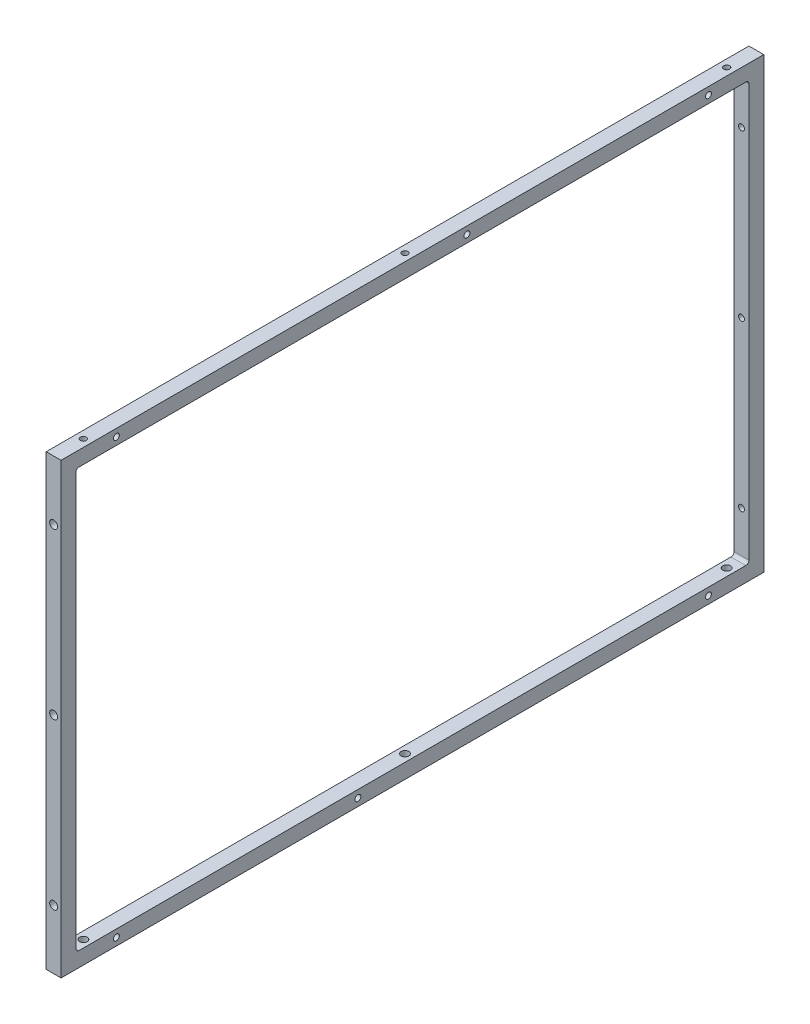
ISO-10303-21;
HEADER;
FILE_DESCRIPTION(('STEP AP214'),'2;1');
FILE_NAME('part.step','',(''),(''),'','','');
FILE_SCHEMA(('AUTOMOTIVE_DESIGN { 1 0 10303 214 1 1 1 1 }'));
ENDSEC;
DATA;
#1=APPLICATION_CONTEXT('core data for automotive mechanical design processes');
#2=APPLICATION_PROTOCOL_DEFINITION('international standard','automotive_design',2000,#1);
#3=PRODUCT_CONTEXT('',#1,'mechanical');
#4=PRODUCT('Part','Part','',(#3));
#5=PRODUCT_RELATED_PRODUCT_CATEGORY('part','',(#4));
#6=PRODUCT_DEFINITION_FORMATION('','',#4);
#7=PRODUCT_DEFINITION_CONTEXT('part definition',#1,'design');
#8=PRODUCT_DEFINITION('design','',#6,#7);
#9=PRODUCT_DEFINITION_SHAPE('','',#8);
#10=(LENGTH_UNIT() NAMED_UNIT(*) SI_UNIT(.MILLI.,.METRE.));
#11=(NAMED_UNIT(*) PLANE_ANGLE_UNIT() SI_UNIT($,.RADIAN.));
#12=(NAMED_UNIT(*) SI_UNIT($,.STERADIAN.) SOLID_ANGLE_UNIT());
#13=UNCERTAINTY_MEASURE_WITH_UNIT(LENGTH_MEASURE(1.E-05),#10,'distance_accuracy_value','');
#14=(GEOMETRIC_REPRESENTATION_CONTEXT(3) GLOBAL_UNCERTAINTY_ASSIGNED_CONTEXT((#13)) GLOBAL_UNIT_ASSIGNED_CONTEXT((#10,
#11,#12)) REPRESENTATION_CONTEXT('',''));
#15=CARTESIAN_POINT('',(0.,0.,0.));
#16=DIRECTION('',(0.,0.,1.));
#17=DIRECTION('',(1.,0.,0.));
#18=AXIS2_PLACEMENT_3D('',#15,#16,#17);
#19=CARTESIAN_POINT('',(9.525,0.,0.));
#20=DIRECTION('',(1.,0.,0.));
#21=DIRECTION('',(0.,0.,-1.));
#22=AXIS2_PLACEMENT_3D('',#19,#20,#21);
#23=PLANE('',#22);
#24=CARTESIAN_POINT('',(9.525,139.12320835,-190.));
#25=DIRECTION('',(-1.,0.,0.));
#26=DIRECTION('',(0.,0.,1.));
#27=AXIS2_PLACEMENT_3D('',#24,#25,#26);
#28=CIRCLE('',#27,1.89865);
#29=CARTESIAN_POINT('',(9.525,139.12320835,-188.10135));
#30=VERTEX_POINT('',#29);
#31=EDGE_CURVE('E398',#30,#30,#28,.T.);
#32=ORIENTED_EDGE('',*,*,#31,.T.);
#33=EDGE_LOOP('',(#32));
#34=FACE_BOUND('',#33,.T.);
#35=CARTESIAN_POINT('',(9.525,139.12320835,-35.));
#36=DIRECTION('',(-1.,0.,0.));
#37=DIRECTION('',(0.,0.,1.));
#38=AXIS2_PLACEMENT_3D('',#35,#36,#37);
#39=CIRCLE('',#38,1.89865);
#40=CARTESIAN_POINT('',(9.525,139.12320835,-33.10135));
#41=VERTEX_POINT('',#40);
#42=EDGE_CURVE('E403',#41,#41,#39,.T.);
#43=ORIENTED_EDGE('',*,*,#42,.T.);
#44=EDGE_LOOP('',(#43));
#45=FACE_BOUND('',#44,.T.);
#46=CARTESIAN_POINT('',(9.525,-139.12320835,-190.));
#47=DIRECTION('',(-1.,0.,0.));
#48=DIRECTION('',(0.,0.,1.));
#49=AXIS2_PLACEMENT_3D('',#46,#47,#48);
#50=CIRCLE('',#49,1.89865);
#51=CARTESIAN_POINT('',(9.525,-139.12320835,-188.10135));
#52=VERTEX_POINT('',#51);
#53=EDGE_CURVE('E409',#52,#52,#50,.T.);
#54=ORIENTED_EDGE('',*,*,#53,.T.);
#55=EDGE_LOOP('',(#54));
#56=FACE_BOUND('',#55,.T.);
#57=CARTESIAN_POINT('',(9.525,-139.12320835,35.));
#58=DIRECTION('',(-1.,0.,0.));
#59=DIRECTION('',(0.,0.,1.));
#60=AXIS2_PLACEMENT_3D('',#57,#58,#59);
#61=CIRCLE('',#60,1.89865);
#62=CARTESIAN_POINT('',(9.525,-139.12320835,36.89865));
#63=VERTEX_POINT('',#62);
#64=EDGE_CURVE('E415',#63,#63,#61,.T.);
#65=ORIENTED_EDGE('',*,*,#64,.T.);
#66=EDGE_LOOP('',(#65));
#67=FACE_BOUND('',#66,.T.);
#68=CARTESIAN_POINT('',(9.525,-139.12320835,190.));
#69=DIRECTION('',(-1.,0.,0.));
#70=DIRECTION('',(0.,0.,1.));
#71=AXIS2_PLACEMENT_3D('',#68,#69,#70);
#72=CIRCLE('',#71,1.89865);
#73=CARTESIAN_POINT('',(9.525,-139.12320835,191.89865));
#74=VERTEX_POINT('',#73);
#75=EDGE_CURVE('E421',#74,#74,#72,.T.);
#76=ORIENTED_EDGE('',*,*,#75,.T.);
#77=EDGE_LOOP('',(#76));
#78=FACE_BOUND('',#77,.T.);
#79=CARTESIAN_POINT('',(9.525,139.12320835,190.));
#80=DIRECTION('',(-1.,0.,0.));
#81=DIRECTION('',(0.,0.,1.));
#82=AXIS2_PLACEMENT_3D('',#79,#80,#81);
#83=CIRCLE('',#82,1.89865);
#84=CARTESIAN_POINT('',(9.525,139.12320835,191.89865));
#85=VERTEX_POINT('',#84);
#86=EDGE_CURVE('E427',#85,#85,#83,.T.);
#87=ORIENTED_EDGE('',*,*,#86,.T.);
#88=EDGE_LOOP('',(#87));
#89=FACE_BOUND('',#88,.T.);
#90=DIRECTION('',(0.,-1.,0.));
#91=VECTOR('',#90,1.);
#92=CARTESIAN_POINT('',(9.525,143.88570835,225.5));
#93=LINE('',#92,#91);
#94=CARTESIAN_POINT('',(9.525,143.88570835,225.5));
#95=VERTEX_POINT('',#94);
#96=CARTESIAN_POINT('',(9.525,-143.88570835,225.5));
#97=VERTEX_POINT('',#96);
#98=EDGE_CURVE('E161',#95,#97,#93,.T.);
#99=ORIENTED_EDGE('',*,*,#98,.T.);
#100=DIRECTION('',(0.,0.,-1.));
#101=VECTOR('',#100,1.);
#102=CARTESIAN_POINT('',(9.525,-143.88570835,225.5));
#103=LINE('',#102,#101);
#104=CARTESIAN_POINT('',(9.525,-143.88570835,-225.5));
#105=VERTEX_POINT('',#104);
#106=EDGE_CURVE('E150',#97,#105,#103,.T.);
#107=ORIENTED_EDGE('',*,*,#106,.T.);
#108=DIRECTION('',(0.,1.,0.));
#109=VECTOR('',#108,1.);
#110=CARTESIAN_POINT('',(9.525,143.88570835,-225.5));
#111=LINE('',#110,#109);
#112=CARTESIAN_POINT('',(9.525,143.88570835,-225.5));
#113=VERTEX_POINT('',#112);
#114=EDGE_CURVE('E160',#105,#113,#111,.T.);
#115=ORIENTED_EDGE('',*,*,#114,.T.);
#116=DIRECTION('',(0.,0.,1.));
#117=VECTOR('',#116,1.);
#118=CARTESIAN_POINT('',(9.525,143.88570835,225.5));
#119=LINE('',#118,#117);
#120=EDGE_CURVE('E165',#113,#95,#119,.T.);
#121=ORIENTED_EDGE('',*,*,#120,.T.);
#122=EDGE_LOOP('',(#99,#107,#115,#121));
#123=FACE_BOUND('',#122,.T.);
#124=DIRECTION('',(0.,0.,-1.));
#125=VECTOR('',#124,1.);
#126=CARTESIAN_POINT('',(9.525,-134.36070835,225.5));
#127=LINE('',#126,#125);
#128=CARTESIAN_POINT('',(9.525,-134.36070835,213.975));
#129=VERTEX_POINT('',#128);
#130=CARTESIAN_POINT('',(9.525,-134.36070835,-213.975));
#131=VERTEX_POINT('',#130);
#132=EDGE_CURVE('E230',#129,#131,#127,.T.);
#133=ORIENTED_EDGE('',*,*,#132,.F.);
#134=CARTESIAN_POINT('',(9.525,-132.36070835,213.975));
#135=DIRECTION('',(1.,0.,0.));
#136=DIRECTION('',(0.,0.,-1.));
#137=AXIS2_PLACEMENT_3D('',#134,#135,#136);
#138=CIRCLE('',#137,2.);
#139=CARTESIAN_POINT('',(9.525,-132.36070835,215.975));
#140=VERTEX_POINT('',#139);
#141=EDGE_CURVE('E204',#129,#140,#138,.F.);
#142=ORIENTED_EDGE('',*,*,#141,.T.);
#143=DIRECTION('',(0.,-1.,0.));
#144=VECTOR('',#143,1.);
#145=CARTESIAN_POINT('',(9.525,143.88570835,215.975));
#146=LINE('',#145,#144);
#147=CARTESIAN_POINT('',(9.525,132.36070835,215.975));
#148=VERTEX_POINT('',#147);
#149=EDGE_CURVE('E224',#148,#140,#146,.T.);
#150=ORIENTED_EDGE('',*,*,#149,.F.);
#151=CARTESIAN_POINT('',(9.525,132.36070835,213.975));
#152=DIRECTION('',(1.,0.,0.));
#153=DIRECTION('',(0.,0.,-1.));
#154=AXIS2_PLACEMENT_3D('',#151,#152,#153);
#155=CIRCLE('',#154,2.);
#156=CARTESIAN_POINT('',(9.525,134.36070835,213.975));
#157=VERTEX_POINT('',#156);
#158=EDGE_CURVE('E200',#148,#157,#155,.F.);
#159=ORIENTED_EDGE('',*,*,#158,.T.);
#160=DIRECTION('',(0.,0.,1.));
#161=VECTOR('',#160,1.);
#162=CARTESIAN_POINT('',(9.525,134.36070835,225.5));
#163=LINE('',#162,#161);
#164=CARTESIAN_POINT('',(9.525,134.36070835,-213.975));
#165=VERTEX_POINT('',#164);
#166=EDGE_CURVE('E229',#165,#157,#163,.T.);
#167=ORIENTED_EDGE('',*,*,#166,.F.);
#168=CARTESIAN_POINT('',(9.525,132.36070835,-213.975));
#169=DIRECTION('',(1.,0.,0.));
#170=DIRECTION('',(0.,0.,-1.));
#171=AXIS2_PLACEMENT_3D('',#168,#169,#170);
#172=CIRCLE('',#171,2.);
#173=CARTESIAN_POINT('',(9.525,132.36070835,-215.975));
#174=VERTEX_POINT('',#173);
#175=EDGE_CURVE('E12',#165,#174,#172,.F.);
#176=ORIENTED_EDGE('',*,*,#175,.T.);
#177=DIRECTION('',(0.,1.,0.));
#178=VECTOR('',#177,1.);
#179=CARTESIAN_POINT('',(9.525,143.88570835,-215.975));
#180=LINE('',#179,#178);
#181=CARTESIAN_POINT('',(9.525,-132.36070835,-215.975));
#182=VERTEX_POINT('',#181);
#183=EDGE_CURVE('E227',#182,#174,#180,.T.);
#184=ORIENTED_EDGE('',*,*,#183,.F.);
#185=CARTESIAN_POINT('',(9.525,-132.36070835,-213.975));
#186=DIRECTION('',(1.,0.,0.));
#187=DIRECTION('',(0.,0.,-1.));
#188=AXIS2_PLACEMENT_3D('',#185,#186,#187);
#189=CIRCLE('',#188,2.);
#190=EDGE_CURVE('E208',#182,#131,#189,.F.);
#191=ORIENTED_EDGE('',*,*,#190,.T.);
#192=EDGE_LOOP('',(#133,#142,#150,#159,#167,#176,#184,#191));
#193=FACE_BOUND('',#192,.T.);
#194=ADVANCED_FACE('F60',(#34,#45,#56,#67,#78,#89,#123,#193),#23,.T.);
#195=CARTESIAN_POINT('',(0.,0.,0.));
#196=DIRECTION('',(1.,0.,0.));
#197=DIRECTION('',(0.,0.,-1.));
#198=AXIS2_PLACEMENT_3D('',#195,#196,#197);
#199=PLANE('',#198);
#200=CARTESIAN_POINT('',(0.,139.12320835,-190.));
#201=DIRECTION('',(-1.,0.,0.));
#202=DIRECTION('',(0.,0.,1.));
#203=AXIS2_PLACEMENT_3D('',#200,#201,#202);
#204=CIRCLE('',#203,1.89864999999997);
#205=CARTESIAN_POINT('',(0.,139.12320835,-188.10135));
#206=VERTEX_POINT('',#205);
#207=EDGE_CURVE('E395',#206,#206,#204,.T.);
#208=ORIENTED_EDGE('',*,*,#207,.F.);
#209=EDGE_LOOP('',(#208));
#210=FACE_BOUND('',#209,.T.);
#211=CARTESIAN_POINT('',(0.,139.12320835,-35.));
#212=DIRECTION('',(-1.,0.,0.));
#213=DIRECTION('',(0.,0.,1.));
#214=AXIS2_PLACEMENT_3D('',#211,#212,#213);
#215=CIRCLE('',#214,1.89864999999997);
#216=CARTESIAN_POINT('',(0.,139.12320835,-33.10135));
#217=VERTEX_POINT('',#216);
#218=EDGE_CURVE('E400',#217,#217,#215,.T.);
#219=ORIENTED_EDGE('',*,*,#218,.F.);
#220=EDGE_LOOP('',(#219));
#221=FACE_BOUND('',#220,.T.);
#222=CARTESIAN_POINT('',(0.,-139.12320835,-190.));
#223=DIRECTION('',(-1.,0.,0.));
#224=DIRECTION('',(0.,0.,1.));
#225=AXIS2_PLACEMENT_3D('',#222,#223,#224);
#226=CIRCLE('',#225,1.89864999999997);
#227=CARTESIAN_POINT('',(0.,-139.12320835,-188.10135));
#228=VERTEX_POINT('',#227);
#229=EDGE_CURVE('E406',#228,#228,#226,.T.);
#230=ORIENTED_EDGE('',*,*,#229,.F.);
#231=EDGE_LOOP('',(#230));
#232=FACE_BOUND('',#231,.T.);
#233=CARTESIAN_POINT('',(0.,-139.12320835,35.));
#234=DIRECTION('',(-1.,0.,0.));
#235=DIRECTION('',(0.,0.,1.));
#236=AXIS2_PLACEMENT_3D('',#233,#234,#235);
#237=CIRCLE('',#236,1.89864999999997);
#238=CARTESIAN_POINT('',(0.,-139.12320835,36.89865));
#239=VERTEX_POINT('',#238);
#240=EDGE_CURVE('E412',#239,#239,#237,.T.);
#241=ORIENTED_EDGE('',*,*,#240,.F.);
#242=EDGE_LOOP('',(#241));
#243=FACE_BOUND('',#242,.T.);
#244=CARTESIAN_POINT('',(0.,-139.12320835,190.));
#245=DIRECTION('',(-1.,0.,0.));
#246=DIRECTION('',(0.,0.,1.));
#247=AXIS2_PLACEMENT_3D('',#244,#245,#246);
#248=CIRCLE('',#247,1.89864999999997);
#249=CARTESIAN_POINT('',(0.,-139.12320835,191.89865));
#250=VERTEX_POINT('',#249);
#251=EDGE_CURVE('E418',#250,#250,#248,.T.);
#252=ORIENTED_EDGE('',*,*,#251,.F.);
#253=EDGE_LOOP('',(#252));
#254=FACE_BOUND('',#253,.T.);
#255=CARTESIAN_POINT('',(0.,139.12320835,190.));
#256=DIRECTION('',(-1.,0.,0.));
#257=DIRECTION('',(0.,0.,1.));
#258=AXIS2_PLACEMENT_3D('',#255,#256,#257);
#259=CIRCLE('',#258,1.89864999999997);
#260=CARTESIAN_POINT('',(0.,139.12320835,191.89865));
#261=VERTEX_POINT('',#260);
#262=EDGE_CURVE('E424',#261,#261,#259,.T.);
#263=ORIENTED_EDGE('',*,*,#262,.F.);
#264=EDGE_LOOP('',(#263));
#265=FACE_BOUND('',#264,.T.);
#266=DIRECTION('',(0.,-1.,0.));
#267=VECTOR('',#266,1.);
#268=CARTESIAN_POINT('',(0.,143.88570835,225.5));
#269=LINE('',#268,#267);
#270=CARTESIAN_POINT('',(0.,143.88570835,225.5));
#271=VERTEX_POINT('',#270);
#272=CARTESIAN_POINT('',(0.,-143.88570835,225.5));
#273=VERTEX_POINT('',#272);
#274=EDGE_CURVE('E173',#271,#273,#269,.T.);
#275=ORIENTED_EDGE('',*,*,#274,.F.);
#276=DIRECTION('',(0.,0.,1.));
#277=VECTOR('',#276,1.);
#278=CARTESIAN_POINT('',(0.,143.88570835,225.5));
#279=LINE('',#278,#277);
#280=CARTESIAN_POINT('',(0.,143.88570835,-225.5));
#281=VERTEX_POINT('',#280);
#282=EDGE_CURVE('E169',#281,#271,#279,.T.);
#283=ORIENTED_EDGE('',*,*,#282,.F.);
#284=DIRECTION('',(0.,1.,0.));
#285=VECTOR('',#284,1.);
#286=CARTESIAN_POINT('',(0.,143.88570835,-225.5));
#287=LINE('',#286,#285);
#288=CARTESIAN_POINT('',(0.,-143.88570835,-225.5));
#289=VERTEX_POINT('',#288);
#290=EDGE_CURVE('E251',#289,#281,#287,.T.);
#291=ORIENTED_EDGE('',*,*,#290,.F.);
#292=DIRECTION('',(0.,0.,-1.));
#293=VECTOR('',#292,1.);
#294=CARTESIAN_POINT('',(0.,-143.88570835,225.5));
#295=LINE('',#294,#293);
#296=EDGE_CURVE('E249',#273,#289,#295,.T.);
#297=ORIENTED_EDGE('',*,*,#296,.F.);
#298=EDGE_LOOP('',(#275,#283,#291,#297));
#299=FACE_BOUND('',#298,.T.);
#300=DIRECTION('',(0.,0.,1.));
#301=VECTOR('',#300,1.);
#302=CARTESIAN_POINT('',(0.,134.36070835,225.5));
#303=LINE('',#302,#301);
#304=CARTESIAN_POINT('',(0.,134.36070835,-213.975));
#305=VERTEX_POINT('',#304);
#306=CARTESIAN_POINT('',(0.,134.36070835,213.975));
#307=VERTEX_POINT('',#306);
#308=EDGE_CURVE('E215',#305,#307,#303,.T.);
#309=ORIENTED_EDGE('',*,*,#308,.T.);
#310=CARTESIAN_POINT('',(0.,132.36070835,213.975));
#311=DIRECTION('',(1.,0.,0.));
#312=DIRECTION('',(0.,0.,-1.));
#313=AXIS2_PLACEMENT_3D('',#310,#311,#312);
#314=CIRCLE('',#313,2.);
#315=CARTESIAN_POINT('',(0.,132.36070835,215.975));
#316=VERTEX_POINT('',#315);
#317=EDGE_CURVE('E198',#307,#316,#314,.T.);
#318=ORIENTED_EDGE('',*,*,#317,.T.);
#319=DIRECTION('',(0.,-1.,0.));
#320=VECTOR('',#319,1.);
#321=CARTESIAN_POINT('',(0.,143.88570835,215.975));
#322=LINE('',#321,#320);
#323=CARTESIAN_POINT('',(0.,-132.36070835,215.975));
#324=VERTEX_POINT('',#323);
#325=EDGE_CURVE('E237',#316,#324,#322,.T.);
#326=ORIENTED_EDGE('',*,*,#325,.T.);
#327=CARTESIAN_POINT('',(0.,-132.36070835,213.975));
#328=DIRECTION('',(1.,0.,0.));
#329=DIRECTION('',(0.,0.,-1.));
#330=AXIS2_PLACEMENT_3D('',#327,#328,#329);
#331=CIRCLE('',#330,2.);
#332=CARTESIAN_POINT('',(0.,-134.36070835,213.975));
#333=VERTEX_POINT('',#332);
#334=EDGE_CURVE('E202',#324,#333,#331,.T.);
#335=ORIENTED_EDGE('',*,*,#334,.T.);
#336=DIRECTION('',(0.,0.,-1.));
#337=VECTOR('',#336,1.);
#338=CARTESIAN_POINT('',(0.,-134.36070835,225.5));
#339=LINE('',#338,#337);
#340=CARTESIAN_POINT('',(0.,-134.36070835,-213.975));
#341=VERTEX_POINT('',#340);
#342=EDGE_CURVE('E240',#333,#341,#339,.T.);
#343=ORIENTED_EDGE('',*,*,#342,.T.);
#344=CARTESIAN_POINT('',(0.,-132.36070835,-213.975));
#345=DIRECTION('',(1.,0.,0.));
#346=DIRECTION('',(0.,0.,-1.));
#347=AXIS2_PLACEMENT_3D('',#344,#345,#346);
#348=CIRCLE('',#347,2.);
#349=CARTESIAN_POINT('',(0.,-132.36070835,-215.975));
#350=VERTEX_POINT('',#349);
#351=EDGE_CURVE('E206',#341,#350,#348,.T.);
#352=ORIENTED_EDGE('',*,*,#351,.T.);
#353=DIRECTION('',(0.,1.,0.));
#354=VECTOR('',#353,1.);
#355=CARTESIAN_POINT('',(0.,143.88570835,-215.975));
#356=LINE('',#355,#354);
#357=CARTESIAN_POINT('',(0.,132.36070835,-215.975));
#358=VERTEX_POINT('',#357);
#359=EDGE_CURVE('E216',#350,#358,#356,.T.);
#360=ORIENTED_EDGE('',*,*,#359,.T.);
#361=CARTESIAN_POINT('',(0.,132.36070835,-213.975));
#362=DIRECTION('',(1.,0.,0.));
#363=DIRECTION('',(0.,0.,-1.));
#364=AXIS2_PLACEMENT_3D('',#361,#362,#363);
#365=CIRCLE('',#364,2.);
#366=EDGE_CURVE('E69',#358,#305,#365,.T.);
#367=ORIENTED_EDGE('',*,*,#366,.T.);
#368=EDGE_LOOP('',(#309,#318,#326,#335,#343,#352,#360,#367));
#369=FACE_BOUND('',#368,.T.);
#370=ADVANCED_FACE('F214',(#210,#221,#232,#243,#254,#265,#299,#369),#199,.F.);
#371=CARTESIAN_POINT('',(9.525,143.88570835,225.5));
#372=DIRECTION('',(0.,0.,-1.));
#373=DIRECTION('',(0.,1.,0.));
#374=AXIS2_PLACEMENT_3D('',#371,#372,#373);
#375=PLANE('',#374);
#376=CARTESIAN_POINT('',(4.76249999999999,105.78570835,225.5));
#377=DIRECTION('',(0.,0.,1.));
#378=DIRECTION('',(1.,0.,0.));
#379=AXIS2_PLACEMENT_3D('',#376,#377,#378);
#380=CIRCLE('',#379,2.55269999999999);
#381=CARTESIAN_POINT('',(7.31519999999998,105.78570835,225.5));
#382=VERTEX_POINT('',#381);
#383=EDGE_CURVE('E430',#382,#382,#380,.T.);
#384=ORIENTED_EDGE('',*,*,#383,.F.);
#385=EDGE_LOOP('',(#384));
#386=FACE_BOUND('',#385,.T.);
#387=CARTESIAN_POINT('',(4.76249999999998,0.,225.5));
#388=DIRECTION('',(0.,0.,1.));
#389=DIRECTION('',(1.,0.,0.));
#390=AXIS2_PLACEMENT_3D('',#387,#388,#389);
#391=CIRCLE('',#390,2.55269999999999);
#392=CARTESIAN_POINT('',(7.31519999999997,0.,225.5));
#393=VERTEX_POINT('',#392);
#394=EDGE_CURVE('E436',#393,#393,#391,.T.);
#395=ORIENTED_EDGE('',*,*,#394,.F.);
#396=EDGE_LOOP('',(#395));
#397=FACE_BOUND('',#396,.T.);
#398=CARTESIAN_POINT('',(4.76249999999999,-105.78570835,225.5));
#399=DIRECTION('',(0.,0.,1.));
#400=DIRECTION('',(1.,0.,0.));
#401=AXIS2_PLACEMENT_3D('',#398,#399,#400);
#402=CIRCLE('',#401,2.55269999999999);
#403=CARTESIAN_POINT('',(7.31519999999998,-105.78570835,225.5));
#404=VERTEX_POINT('',#403);
#405=EDGE_CURVE('E442',#404,#404,#402,.T.);
#406=ORIENTED_EDGE('',*,*,#405,.F.);
#407=EDGE_LOOP('',(#406));
#408=FACE_BOUND('',#407,.T.);
#409=ORIENTED_EDGE('',*,*,#274,.T.);
#410=DIRECTION('',(-1.,0.,0.));
#411=VECTOR('',#410,1.);
#412=CARTESIAN_POINT('',(9.525,-143.88570835,225.5));
#413=LINE('',#412,#411);
#414=EDGE_CURVE('E154',#97,#273,#413,.T.);
#415=ORIENTED_EDGE('',*,*,#414,.F.);
#416=ORIENTED_EDGE('',*,*,#98,.F.);
#417=DIRECTION('',(-1.,0.,0.));
#418=VECTOR('',#417,1.);
#419=CARTESIAN_POINT('',(9.525,143.88570835,225.5));
#420=LINE('',#419,#418);
#421=EDGE_CURVE('E247',#95,#271,#420,.T.);
#422=ORIENTED_EDGE('',*,*,#421,.T.);
#423=EDGE_LOOP('',(#409,#415,#416,#422));
#424=FACE_BOUND('',#423,.T.);
#425=ADVANCED_FACE('F171',(#386,#397,#408,#424),#375,.F.);
#426=CARTESIAN_POINT('',(9.525,-143.88570835,225.5));
#427=DIRECTION('',(0.,1.,0.));
#428=DIRECTION('',(0.,0.,1.));
#429=AXIS2_PLACEMENT_3D('',#426,#427,#428);
#430=PLANE('',#429);
#431=CARTESIAN_POINT('',(4.7625,-143.88570835,-206.45));
#432=DIRECTION('',(0.,-1.,0.));
#433=DIRECTION('',(0.,0.,-1.));
#434=AXIS2_PLACEMENT_3D('',#431,#432,#433);
#435=CIRCLE('',#434,2.48919999999999);
#436=CARTESIAN_POINT('',(4.7625,-143.88570835,-208.9392));
#437=VERTEX_POINT('',#436);
#438=EDGE_CURVE('E466',#437,#437,#435,.T.);
#439=ORIENTED_EDGE('',*,*,#438,.F.);
#440=EDGE_LOOP('',(#439));
#441=FACE_BOUND('',#440,.T.);
#442=CARTESIAN_POINT('',(4.7625,-143.88570835,0.));
#443=DIRECTION('',(0.,-1.,0.));
#444=DIRECTION('',(0.,0.,-1.));
#445=AXIS2_PLACEMENT_3D('',#442,#443,#444);
#446=CIRCLE('',#445,2.48919999999999);
#447=CARTESIAN_POINT('',(4.7625,-143.88570835,-2.48919999999999));
#448=VERTEX_POINT('',#447);
#449=EDGE_CURVE('E472',#448,#448,#446,.T.);
#450=ORIENTED_EDGE('',*,*,#449,.F.);
#451=EDGE_LOOP('',(#450));
#452=FACE_BOUND('',#451,.T.);
#453=CARTESIAN_POINT('',(4.7625,-143.88570835,206.45));
#454=DIRECTION('',(0.,-1.,0.));
#455=DIRECTION('',(0.,0.,-1.));
#456=AXIS2_PLACEMENT_3D('',#453,#454,#455);
#457=CIRCLE('',#456,2.48919999999999);
#458=CARTESIAN_POINT('',(4.7625,-143.88570835,203.9608));
#459=VERTEX_POINT('',#458);
#460=EDGE_CURVE('E478',#459,#459,#457,.T.);
#461=ORIENTED_EDGE('',*,*,#460,.F.);
#462=EDGE_LOOP('',(#461));
#463=FACE_BOUND('',#462,.T.);
#464=ORIENTED_EDGE('',*,*,#296,.T.);
#465=DIRECTION('',(-1.,0.,0.));
#466=VECTOR('',#465,1.);
#467=CARTESIAN_POINT('',(9.525,-143.88570835,-225.5));
#468=LINE('',#467,#466);
#469=EDGE_CURVE('E157',#105,#289,#468,.T.);
#470=ORIENTED_EDGE('',*,*,#469,.F.);
#471=ORIENTED_EDGE('',*,*,#106,.F.);
#472=ORIENTED_EDGE('',*,*,#414,.T.);
#473=EDGE_LOOP('',(#464,#470,#471,#472));
#474=FACE_BOUND('',#473,.T.);
#475=ADVANCED_FACE('F152',(#441,#452,#463,#474),#430,.F.);
#476=CARTESIAN_POINT('',(9.525,143.88570835,-225.5));
#477=DIRECTION('',(0.,0.,1.));
#478=DIRECTION('',(0.,-1.,0.));
#479=AXIS2_PLACEMENT_3D('',#476,#477,#478);
#480=PLANE('',#479);
#481=CARTESIAN_POINT('',(4.76249999999999,105.78570835,-225.5));
#482=DIRECTION('',(0.,0.,-1.));
#483=DIRECTION('',(0.,1.,0.));
#484=AXIS2_PLACEMENT_3D('',#481,#482,#483);
#485=CIRCLE('',#484,1.89864999999999);
#486=CARTESIAN_POINT('',(4.76249999999999,107.68435835,-225.5));
#487=VERTEX_POINT('',#486);
#488=EDGE_CURVE('E448',#487,#487,#485,.T.);
#489=ORIENTED_EDGE('',*,*,#488,.F.);
#490=EDGE_LOOP('',(#489));
#491=FACE_BOUND('',#490,.T.);
#492=CARTESIAN_POINT('',(4.76249999999998,0.,-225.5));
#493=DIRECTION('',(0.,0.,-1.));
#494=DIRECTION('',(0.,1.,0.));
#495=AXIS2_PLACEMENT_3D('',#492,#493,#494);
#496=CIRCLE('',#495,1.89864999999999);
#497=CARTESIAN_POINT('',(4.76249999999998,1.89865000000003,-225.5));
#498=VERTEX_POINT('',#497);
#499=EDGE_CURVE('E454',#498,#498,#496,.T.);
#500=ORIENTED_EDGE('',*,*,#499,.F.);
#501=EDGE_LOOP('',(#500));
#502=FACE_BOUND('',#501,.T.);
#503=CARTESIAN_POINT('',(4.76249999999999,-105.78570835,-225.5));
#504=DIRECTION('',(0.,0.,-1.));
#505=DIRECTION('',(0.,1.,0.));
#506=AXIS2_PLACEMENT_3D('',#503,#504,#505);
#507=CIRCLE('',#506,1.89864999999999);
#508=CARTESIAN_POINT('',(4.76249999999999,-103.88705835,-225.5));
#509=VERTEX_POINT('',#508);
#510=EDGE_CURVE('E460',#509,#509,#507,.T.);
#511=ORIENTED_EDGE('',*,*,#510,.F.);
#512=EDGE_LOOP('',(#511));
#513=FACE_BOUND('',#512,.T.);
#514=ORIENTED_EDGE('',*,*,#290,.T.);
#515=DIRECTION('',(-1.,0.,0.));
#516=VECTOR('',#515,1.);
#517=CARTESIAN_POINT('',(9.525,143.88570835,-225.5));
#518=LINE('',#517,#516);
#519=EDGE_CURVE('E178',#113,#281,#518,.T.);
#520=ORIENTED_EDGE('',*,*,#519,.F.);
#521=ORIENTED_EDGE('',*,*,#114,.F.);
#522=ORIENTED_EDGE('',*,*,#469,.T.);
#523=EDGE_LOOP('',(#514,#520,#521,#522));
#524=FACE_BOUND('',#523,.T.);
#525=ADVANCED_FACE('F262',(#491,#502,#513,#524),#480,.F.);
#526=CARTESIAN_POINT('',(9.525,143.88570835,225.5));
#527=DIRECTION('',(0.,-1.,0.));
#528=DIRECTION('',(0.,0.,-1.));
#529=AXIS2_PLACEMENT_3D('',#526,#527,#528);
#530=PLANE('',#529);
#531=CARTESIAN_POINT('',(4.7625,143.88570835,-206.45));
#532=DIRECTION('',(0.,1.,0.));
#533=DIRECTION('',(0.,0.,1.));
#534=AXIS2_PLACEMENT_3D('',#531,#532,#533);
#535=CIRCLE('',#534,1.89864999999999);
#536=CARTESIAN_POINT('',(4.7625,143.88570835,-204.55135));
#537=VERTEX_POINT('',#536);
#538=EDGE_CURVE('E380',#537,#537,#535,.T.);
#539=ORIENTED_EDGE('',*,*,#538,.F.);
#540=EDGE_LOOP('',(#539));
#541=FACE_BOUND('',#540,.T.);
#542=CARTESIAN_POINT('',(4.7625,143.88570835,0.));
#543=DIRECTION('',(0.,1.,0.));
#544=DIRECTION('',(0.,0.,1.));
#545=AXIS2_PLACEMENT_3D('',#542,#543,#544);
#546=CIRCLE('',#545,1.89864999999999);
#547=CARTESIAN_POINT('',(4.7625,143.88570835,1.89864999999999));
#548=VERTEX_POINT('',#547);
#549=EDGE_CURVE('E382',#548,#548,#546,.T.);
#550=ORIENTED_EDGE('',*,*,#549,.F.);
#551=EDGE_LOOP('',(#550));
#552=FACE_BOUND('',#551,.T.);
#553=CARTESIAN_POINT('',(4.7625,143.88570835,206.45));
#554=DIRECTION('',(0.,1.,0.));
#555=DIRECTION('',(0.,0.,1.));
#556=AXIS2_PLACEMENT_3D('',#553,#554,#555);
#557=CIRCLE('',#556,1.89864999999999);
#558=CARTESIAN_POINT('',(4.7625,143.88570835,208.34865));
#559=VERTEX_POINT('',#558);
#560=EDGE_CURVE('E389',#559,#559,#557,.T.);
#561=ORIENTED_EDGE('',*,*,#560,.F.);
#562=EDGE_LOOP('',(#561));
#563=FACE_BOUND('',#562,.T.);
#564=ORIENTED_EDGE('',*,*,#282,.T.);
#565=ORIENTED_EDGE('',*,*,#421,.F.);
#566=ORIENTED_EDGE('',*,*,#120,.F.);
#567=ORIENTED_EDGE('',*,*,#519,.T.);
#568=EDGE_LOOP('',(#564,#565,#566,#567));
#569=FACE_BOUND('',#568,.T.);
#570=ADVANCED_FACE('F258',(#541,#552,#563,#569),#530,.F.);
#571=CARTESIAN_POINT('',(9.525,143.88570835,215.975));
#572=DIRECTION('',(0.,0.,-1.));
#573=DIRECTION('',(0.,1.,0.));
#574=AXIS2_PLACEMENT_3D('',#571,#572,#573);
#575=PLANE('',#574);
#576=CARTESIAN_POINT('',(4.76249999999999,105.78570835,215.975));
#577=DIRECTION('',(0.,0.,-1.));
#578=DIRECTION('',(0.,1.,0.));
#579=AXIS2_PLACEMENT_3D('',#576,#577,#578);
#580=CIRCLE('',#579,2.55269999999997);
#581=CARTESIAN_POINT('',(4.76249999999999,108.33840835,215.975));
#582=VERTEX_POINT('',#581);
#583=EDGE_CURVE('E433',#582,#582,#580,.T.);
#584=ORIENTED_EDGE('',*,*,#583,.F.);
#585=EDGE_LOOP('',(#584));
#586=FACE_BOUND('',#585,.T.);
#587=CARTESIAN_POINT('',(4.76249999999998,0.,215.975));
#588=DIRECTION('',(0.,0.,-1.));
#589=DIRECTION('',(0.,1.,0.));
#590=AXIS2_PLACEMENT_3D('',#587,#588,#589);
#591=CIRCLE('',#590,2.55269999999997);
#592=CARTESIAN_POINT('',(4.76249999999998,2.5527,215.975));
#593=VERTEX_POINT('',#592);
#594=EDGE_CURVE('E439',#593,#593,#591,.T.);
#595=ORIENTED_EDGE('',*,*,#594,.F.);
#596=EDGE_LOOP('',(#595));
#597=FACE_BOUND('',#596,.T.);
#598=CARTESIAN_POINT('',(4.76249999999999,-105.78570835,215.975));
#599=DIRECTION('',(0.,0.,-1.));
#600=DIRECTION('',(0.,1.,0.));
#601=AXIS2_PLACEMENT_3D('',#598,#599,#600);
#602=CIRCLE('',#601,2.55269999999997);
#603=CARTESIAN_POINT('',(4.76249999999999,-103.23300835,215.975));
#604=VERTEX_POINT('',#603);
#605=EDGE_CURVE('E445',#604,#604,#602,.T.);
#606=ORIENTED_EDGE('',*,*,#605,.F.);
#607=EDGE_LOOP('',(#606));
#608=FACE_BOUND('',#607,.T.);
#609=ORIENTED_EDGE('',*,*,#325,.F.);
#610=DIRECTION('',(-1.,0.,0.));
#611=VECTOR('',#610,1.);
#612=CARTESIAN_POINT('',(9.525,132.36070835,215.975));
#613=LINE('',#612,#611);
#614=EDGE_CURVE('E187',#316,#148,#613,.F.);
#615=ORIENTED_EDGE('',*,*,#614,.T.);
#616=ORIENTED_EDGE('',*,*,#149,.T.);
#617=DIRECTION('',(-1.,0.,0.));
#618=VECTOR('',#617,1.);
#619=CARTESIAN_POINT('',(0.,-132.36070835,215.975));
#620=LINE('',#619,#618);
#621=EDGE_CURVE('E184',#140,#324,#620,.T.);
#622=ORIENTED_EDGE('',*,*,#621,.T.);
#623=EDGE_LOOP('',(#609,#615,#616,#622));
#624=FACE_BOUND('',#623,.T.);
#625=ADVANCED_FACE('F270',(#586,#597,#608,#624),#575,.T.);
#626=CARTESIAN_POINT('',(9.525,-134.36070835,225.5));
#627=DIRECTION('',(0.,1.,0.));
#628=DIRECTION('',(0.,0.,1.));
#629=AXIS2_PLACEMENT_3D('',#626,#627,#628);
#630=PLANE('',#629);
#631=CARTESIAN_POINT('',(4.7625,-134.36070835,-206.45));
#632=DIRECTION('',(0.,1.,0.));
#633=DIRECTION('',(0.,0.,1.));
#634=AXIS2_PLACEMENT_3D('',#631,#632,#633);
#635=CIRCLE('',#634,2.48919999999999);
#636=CARTESIAN_POINT('',(4.7625,-134.36070835,-203.9608));
#637=VERTEX_POINT('',#636);
#638=EDGE_CURVE('E469',#637,#637,#635,.T.);
#639=ORIENTED_EDGE('',*,*,#638,.F.);
#640=EDGE_LOOP('',(#639));
#641=FACE_BOUND('',#640,.T.);
#642=CARTESIAN_POINT('',(4.7625,-134.36070835,0.));
#643=DIRECTION('',(0.,1.,0.));
#644=DIRECTION('',(0.,0.,1.));
#645=AXIS2_PLACEMENT_3D('',#642,#643,#644);
#646=CIRCLE('',#645,2.48919999999999);
#647=CARTESIAN_POINT('',(4.7625,-134.36070835,2.48919999999999));
#648=VERTEX_POINT('',#647);
#649=EDGE_CURVE('E475',#648,#648,#646,.T.);
#650=ORIENTED_EDGE('',*,*,#649,.F.);
#651=EDGE_LOOP('',(#650));
#652=FACE_BOUND('',#651,.T.);
#653=CARTESIAN_POINT('',(4.7625,-134.36070835,206.45));
#654=DIRECTION('',(0.,1.,0.));
#655=DIRECTION('',(0.,0.,1.));
#656=AXIS2_PLACEMENT_3D('',#653,#654,#655);
#657=CIRCLE('',#656,2.48919999999999);
#658=CARTESIAN_POINT('',(4.7625,-134.36070835,208.9392));
#659=VERTEX_POINT('',#658);
#660=EDGE_CURVE('E241',#659,#659,#657,.T.);
#661=ORIENTED_EDGE('',*,*,#660,.F.);
#662=EDGE_LOOP('',(#661));
#663=FACE_BOUND('',#662,.T.);
#664=ORIENTED_EDGE('',*,*,#342,.F.);
#665=DIRECTION('',(-1.,0.,0.));
#666=VECTOR('',#665,1.);
#667=CARTESIAN_POINT('',(9.525,-134.36070835,213.975));
#668=LINE('',#667,#666);
#669=EDGE_CURVE('E192',#333,#129,#668,.F.);
#670=ORIENTED_EDGE('',*,*,#669,.T.);
#671=ORIENTED_EDGE('',*,*,#132,.T.);
#672=DIRECTION('',(-1.,0.,0.));
#673=VECTOR('',#672,1.);
#674=CARTESIAN_POINT('',(0.,-134.36070835,-213.975));
#675=LINE('',#674,#673);
#676=EDGE_CURVE('E189',#131,#341,#675,.T.);
#677=ORIENTED_EDGE('',*,*,#676,.T.);
#678=EDGE_LOOP('',(#664,#670,#671,#677));
#679=FACE_BOUND('',#678,.T.);
#680=ADVANCED_FACE('F290',(#641,#652,#663,#679),#630,.T.);
#681=CARTESIAN_POINT('',(9.525,143.88570835,-215.975));
#682=DIRECTION('',(0.,0.,1.));
#683=DIRECTION('',(0.,-1.,0.));
#684=AXIS2_PLACEMENT_3D('',#681,#682,#683);
#685=PLANE('',#684);
#686=CARTESIAN_POINT('',(4.76249999999999,105.78570835,-215.975));
#687=DIRECTION('',(0.,0.,1.));
#688=DIRECTION('',(0.,-1.,0.));
#689=AXIS2_PLACEMENT_3D('',#686,#687,#688);
#690=CIRCLE('',#689,1.89864999999998);
#691=CARTESIAN_POINT('',(4.76249999999999,103.88705835,-215.975));
#692=VERTEX_POINT('',#691);
#693=EDGE_CURVE('E451',#692,#692,#690,.T.);
#694=ORIENTED_EDGE('',*,*,#693,.F.);
#695=EDGE_LOOP('',(#694));
#696=FACE_BOUND('',#695,.T.);
#697=CARTESIAN_POINT('',(4.76249999999998,0.,-215.975));
#698=DIRECTION('',(0.,0.,1.));
#699=DIRECTION('',(0.,-1.,0.));
#700=AXIS2_PLACEMENT_3D('',#697,#698,#699);
#701=CIRCLE('',#700,1.89864999999998);
#702=CARTESIAN_POINT('',(4.76249999999998,-1.89864999999994,-215.975));
#703=VERTEX_POINT('',#702);
#704=EDGE_CURVE('E457',#703,#703,#701,.T.);
#705=ORIENTED_EDGE('',*,*,#704,.F.);
#706=EDGE_LOOP('',(#705));
#707=FACE_BOUND('',#706,.T.);
#708=CARTESIAN_POINT('',(4.76249999999999,-105.78570835,-215.975));
#709=DIRECTION('',(0.,0.,1.));
#710=DIRECTION('',(0.,-1.,0.));
#711=AXIS2_PLACEMENT_3D('',#708,#709,#710);
#712=CIRCLE('',#711,1.89864999999998);
#713=CARTESIAN_POINT('',(4.76249999999999,-107.68435835,-215.975));
#714=VERTEX_POINT('',#713);
#715=EDGE_CURVE('E463',#714,#714,#712,.T.);
#716=ORIENTED_EDGE('',*,*,#715,.F.);
#717=EDGE_LOOP('',(#716));
#718=FACE_BOUND('',#717,.T.);
#719=ORIENTED_EDGE('',*,*,#359,.F.);
#720=DIRECTION('',(-1.,0.,0.));
#721=VECTOR('',#720,1.);
#722=CARTESIAN_POINT('',(9.525,-132.36070835,-215.975));
#723=LINE('',#722,#721);
#724=EDGE_CURVE('E81',#350,#182,#723,.F.);
#725=ORIENTED_EDGE('',*,*,#724,.T.);
#726=ORIENTED_EDGE('',*,*,#183,.T.);
#727=DIRECTION('',(-1.,0.,0.));
#728=VECTOR('',#727,1.);
#729=CARTESIAN_POINT('',(0.,132.36070835,-215.975));
#730=LINE('',#729,#728);
#731=EDGE_CURVE('E194',#174,#358,#730,.T.);
#732=ORIENTED_EDGE('',*,*,#731,.T.);
#733=EDGE_LOOP('',(#719,#725,#726,#732));
#734=FACE_BOUND('',#733,.T.);
#735=ADVANCED_FACE('F226',(#696,#707,#718,#734),#685,.T.);
#736=CARTESIAN_POINT('',(9.525,134.36070835,225.5));
#737=DIRECTION('',(0.,-1.,0.));
#738=DIRECTION('',(0.,0.,-1.));
#739=AXIS2_PLACEMENT_3D('',#736,#737,#738);
#740=PLANE('',#739);
#741=CARTESIAN_POINT('',(4.7625,134.36070835,-206.45));
#742=DIRECTION('',(0.,-1.,0.));
#743=DIRECTION('',(0.,0.,-1.));
#744=AXIS2_PLACEMENT_3D('',#741,#742,#743);
#745=CIRCLE('',#744,1.89864999999999);
#746=CARTESIAN_POINT('',(4.7625,134.36070835,-208.34865));
#747=VERTEX_POINT('',#746);
#748=EDGE_CURVE('E64',#747,#747,#745,.T.);
#749=ORIENTED_EDGE('',*,*,#748,.F.);
#750=EDGE_LOOP('',(#749));
#751=FACE_BOUND('',#750,.T.);
#752=CARTESIAN_POINT('',(4.7625,134.36070835,0.));
#753=DIRECTION('',(0.,-1.,0.));
#754=DIRECTION('',(0.,0.,-1.));
#755=AXIS2_PLACEMENT_3D('',#752,#753,#754);
#756=CIRCLE('',#755,1.89864999999999);
#757=CARTESIAN_POINT('',(4.7625,134.36070835,-1.89864999999999));
#758=VERTEX_POINT('',#757);
#759=EDGE_CURVE('E386',#758,#758,#756,.T.);
#760=ORIENTED_EDGE('',*,*,#759,.F.);
#761=EDGE_LOOP('',(#760));
#762=FACE_BOUND('',#761,.T.);
#763=CARTESIAN_POINT('',(4.7625,134.36070835,206.45));
#764=DIRECTION('',(0.,-1.,0.));
#765=DIRECTION('',(0.,0.,-1.));
#766=AXIS2_PLACEMENT_3D('',#763,#764,#765);
#767=CIRCLE('',#766,1.89864999999999);
#768=CARTESIAN_POINT('',(4.7625,134.36070835,204.55135));
#769=VERTEX_POINT('',#768);
#770=EDGE_CURVE('E392',#769,#769,#767,.T.);
#771=ORIENTED_EDGE('',*,*,#770,.F.);
#772=EDGE_LOOP('',(#771));
#773=FACE_BOUND('',#772,.T.);
#774=ORIENTED_EDGE('',*,*,#166,.T.);
#775=DIRECTION('',(-1.,0.,0.));
#776=VECTOR('',#775,1.);
#777=CARTESIAN_POINT('',(0.,134.36070835,213.975));
#778=LINE('',#777,#776);
#779=EDGE_CURVE('E176',#157,#307,#778,.T.);
#780=ORIENTED_EDGE('',*,*,#779,.T.);
#781=ORIENTED_EDGE('',*,*,#308,.F.);
#782=DIRECTION('',(-1.,0.,0.));
#783=VECTOR('',#782,1.);
#784=CARTESIAN_POINT('',(9.525,134.36070835,-213.975));
#785=LINE('',#784,#783);
#786=EDGE_CURVE('E174',#305,#165,#785,.F.);
#787=ORIENTED_EDGE('',*,*,#786,.T.);
#788=EDGE_LOOP('',(#774,#780,#781,#787));
#789=FACE_BOUND('',#788,.T.);
#790=ADVANCED_FACE('F222',(#751,#762,#773,#789),#740,.T.);
#791=CARTESIAN_POINT('',(9.525,132.36070835,213.975));
#792=DIRECTION('',(1.,0.,0.));
#793=DIRECTION('',(0.,0.,-1.));
#794=AXIS2_PLACEMENT_3D('',#791,#792,#793);
#795=CYLINDRICAL_SURFACE('',#794,2.);
#796=ORIENTED_EDGE('',*,*,#158,.F.);
#797=ORIENTED_EDGE('',*,*,#614,.F.);
#798=ORIENTED_EDGE('',*,*,#317,.F.);
#799=ORIENTED_EDGE('',*,*,#779,.F.);
#800=EDGE_LOOP('',(#796,#797,#798,#799));
#801=FACE_BOUND('',#800,.T.);
#802=ADVANCED_FACE('F300',(#801),#795,.F.);
#803=CARTESIAN_POINT('',(9.525,-132.36070835,213.975));
#804=DIRECTION('',(1.,0.,0.));
#805=DIRECTION('',(0.,0.,-1.));
#806=AXIS2_PLACEMENT_3D('',#803,#804,#805);
#807=CYLINDRICAL_SURFACE('',#806,2.);
#808=ORIENTED_EDGE('',*,*,#141,.F.);
#809=ORIENTED_EDGE('',*,*,#669,.F.);
#810=ORIENTED_EDGE('',*,*,#334,.F.);
#811=ORIENTED_EDGE('',*,*,#621,.F.);
#812=EDGE_LOOP('',(#808,#809,#810,#811));
#813=FACE_BOUND('',#812,.T.);
#814=ADVANCED_FACE('F491',(#813),#807,.F.);
#815=CARTESIAN_POINT('',(9.525,-132.36070835,-213.975));
#816=DIRECTION('',(1.,0.,0.));
#817=DIRECTION('',(0.,0.,-1.));
#818=AXIS2_PLACEMENT_3D('',#815,#816,#817);
#819=CYLINDRICAL_SURFACE('',#818,2.);
#820=ORIENTED_EDGE('',*,*,#190,.F.);
#821=ORIENTED_EDGE('',*,*,#724,.F.);
#822=ORIENTED_EDGE('',*,*,#351,.F.);
#823=ORIENTED_EDGE('',*,*,#676,.F.);
#824=EDGE_LOOP('',(#820,#821,#822,#823));
#825=FACE_BOUND('',#824,.T.);
#826=ADVANCED_FACE('F498',(#825),#819,.F.);
#827=CARTESIAN_POINT('',(9.525,132.36070835,-213.975));
#828=DIRECTION('',(1.,0.,0.));
#829=DIRECTION('',(0.,0.,-1.));
#830=AXIS2_PLACEMENT_3D('',#827,#828,#829);
#831=CYLINDRICAL_SURFACE('',#830,2.);
#832=ORIENTED_EDGE('',*,*,#175,.F.);
#833=ORIENTED_EDGE('',*,*,#786,.F.);
#834=ORIENTED_EDGE('',*,*,#366,.F.);
#835=ORIENTED_EDGE('',*,*,#731,.F.);
#836=EDGE_LOOP('',(#832,#833,#834,#835));
#837=FACE_BOUND('',#836,.T.);
#838=ADVANCED_FACE('F62',(#837),#831,.F.);
#839=CARTESIAN_POINT('',(4.7625,-143.88570835,206.45));
#840=DIRECTION('',(0.,-1.,0.));
#841=DIRECTION('',(0.,0.,-1.));
#842=AXIS2_PLACEMENT_3D('',#839,#840,#841);
#843=CYLINDRICAL_SURFACE('',#842,2.48919999999999);
#844=ORIENTED_EDGE('',*,*,#460,.T.);
#845=EDGE_LOOP('',(#844));
#846=FACE_BOUND('',#845,.T.);
#847=ORIENTED_EDGE('',*,*,#660,.T.);
#848=EDGE_LOOP('',(#847));
#849=FACE_BOUND('',#848,.T.);
#850=ADVANCED_FACE('F302',(#846,#849),#843,.F.);
#851=CARTESIAN_POINT('',(4.7625,-143.88570835,0.));
#852=DIRECTION('',(0.,-1.,0.));
#853=DIRECTION('',(0.,0.,-1.));
#854=AXIS2_PLACEMENT_3D('',#851,#852,#853);
#855=CYLINDRICAL_SURFACE('',#854,2.48919999999999);
#856=ORIENTED_EDGE('',*,*,#449,.T.);
#857=EDGE_LOOP('',(#856));
#858=FACE_BOUND('',#857,.T.);
#859=ORIENTED_EDGE('',*,*,#649,.T.);
#860=EDGE_LOOP('',(#859));
#861=FACE_BOUND('',#860,.T.);
#862=ADVANCED_FACE('F305',(#858,#861),#855,.F.);
#863=CARTESIAN_POINT('',(4.7625,-143.88570835,-206.45));
#864=DIRECTION('',(0.,-1.,0.));
#865=DIRECTION('',(0.,0.,-1.));
#866=AXIS2_PLACEMENT_3D('',#863,#864,#865);
#867=CYLINDRICAL_SURFACE('',#866,2.48919999999999);
#868=ORIENTED_EDGE('',*,*,#438,.T.);
#869=EDGE_LOOP('',(#868));
#870=FACE_BOUND('',#869,.T.);
#871=ORIENTED_EDGE('',*,*,#638,.T.);
#872=EDGE_LOOP('',(#871));
#873=FACE_BOUND('',#872,.T.);
#874=ADVANCED_FACE('F309',(#870,#873),#867,.F.);
#875=CARTESIAN_POINT('',(4.76249999999999,-105.78570835,-225.5));
#876=DIRECTION('',(0.,0.,-1.));
#877=DIRECTION('',(0.,1.,0.));
#878=AXIS2_PLACEMENT_3D('',#875,#876,#877);
#879=CYLINDRICAL_SURFACE('',#878,1.89864999999998);
#880=ORIENTED_EDGE('',*,*,#715,.T.);
#881=EDGE_LOOP('',(#880));
#882=FACE_BOUND('',#881,.T.);
#883=ORIENTED_EDGE('',*,*,#510,.T.);
#884=EDGE_LOOP('',(#883));
#885=FACE_BOUND('',#884,.T.);
#886=ADVANCED_FACE('F313',(#882,#885),#879,.F.);
#887=CARTESIAN_POINT('',(4.76249999999998,0.,-225.5));
#888=DIRECTION('',(0.,0.,-1.));
#889=DIRECTION('',(0.,1.,0.));
#890=AXIS2_PLACEMENT_3D('',#887,#888,#889);
#891=CYLINDRICAL_SURFACE('',#890,1.89864999999998);
#892=ORIENTED_EDGE('',*,*,#704,.T.);
#893=EDGE_LOOP('',(#892));
#894=FACE_BOUND('',#893,.T.);
#895=ORIENTED_EDGE('',*,*,#499,.T.);
#896=EDGE_LOOP('',(#895));
#897=FACE_BOUND('',#896,.T.);
#898=ADVANCED_FACE('F317',(#894,#897),#891,.F.);
#899=CARTESIAN_POINT('',(4.76249999999999,105.78570835,-225.5));
#900=DIRECTION('',(0.,0.,-1.));
#901=DIRECTION('',(0.,1.,0.));
#902=AXIS2_PLACEMENT_3D('',#899,#900,#901);
#903=CYLINDRICAL_SURFACE('',#902,1.89864999999998);
#904=ORIENTED_EDGE('',*,*,#693,.T.);
#905=EDGE_LOOP('',(#904));
#906=FACE_BOUND('',#905,.T.);
#907=ORIENTED_EDGE('',*,*,#488,.T.);
#908=EDGE_LOOP('',(#907));
#909=FACE_BOUND('',#908,.T.);
#910=ADVANCED_FACE('F321',(#906,#909),#903,.F.);
#911=CARTESIAN_POINT('',(4.76249999999999,-105.78570835,225.5));
#912=DIRECTION('',(0.,0.,1.));
#913=DIRECTION('',(1.,0.,0.));
#914=AXIS2_PLACEMENT_3D('',#911,#912,#913);
#915=CYLINDRICAL_SURFACE('',#914,2.55269999999997);
#916=ORIENTED_EDGE('',*,*,#605,.T.);
#917=EDGE_LOOP('',(#916));
#918=FACE_BOUND('',#917,.T.);
#919=ORIENTED_EDGE('',*,*,#405,.T.);
#920=EDGE_LOOP('',(#919));
#921=FACE_BOUND('',#920,.T.);
#922=ADVANCED_FACE('F325',(#918,#921),#915,.F.);
#923=CARTESIAN_POINT('',(4.76249999999998,0.,225.5));
#924=DIRECTION('',(0.,0.,1.));
#925=DIRECTION('',(1.,0.,0.));
#926=AXIS2_PLACEMENT_3D('',#923,#924,#925);
#927=CYLINDRICAL_SURFACE('',#926,2.55269999999997);
#928=ORIENTED_EDGE('',*,*,#594,.T.);
#929=EDGE_LOOP('',(#928));
#930=FACE_BOUND('',#929,.T.);
#931=ORIENTED_EDGE('',*,*,#394,.T.);
#932=EDGE_LOOP('',(#931));
#933=FACE_BOUND('',#932,.T.);
#934=ADVANCED_FACE('F329',(#930,#933),#927,.F.);
#935=CARTESIAN_POINT('',(4.76249999999999,105.78570835,225.5));
#936=DIRECTION('',(0.,0.,1.));
#937=DIRECTION('',(1.,0.,0.));
#938=AXIS2_PLACEMENT_3D('',#935,#936,#937);
#939=CYLINDRICAL_SURFACE('',#938,2.55269999999997);
#940=ORIENTED_EDGE('',*,*,#583,.T.);
#941=EDGE_LOOP('',(#940));
#942=FACE_BOUND('',#941,.T.);
#943=ORIENTED_EDGE('',*,*,#383,.T.);
#944=EDGE_LOOP('',(#943));
#945=FACE_BOUND('',#944,.T.);
#946=ADVANCED_FACE('F333',(#942,#945),#939,.F.);
#947=CARTESIAN_POINT('',(0.,139.12320835,190.));
#948=DIRECTION('',(-1.,0.,0.));
#949=DIRECTION('',(0.,0.,1.));
#950=AXIS2_PLACEMENT_3D('',#947,#948,#949);
#951=CYLINDRICAL_SURFACE('',#950,1.89864999999999);
#952=ORIENTED_EDGE('',*,*,#86,.F.);
#953=EDGE_LOOP('',(#952));
#954=FACE_BOUND('',#953,.T.);
#955=ORIENTED_EDGE('',*,*,#262,.T.);
#956=EDGE_LOOP('',(#955));
#957=FACE_BOUND('',#956,.T.);
#958=ADVANCED_FACE('F337',(#954,#957),#951,.F.);
#959=CARTESIAN_POINT('',(0.,-139.12320835,190.));
#960=DIRECTION('',(-1.,0.,0.));
#961=DIRECTION('',(0.,0.,1.));
#962=AXIS2_PLACEMENT_3D('',#959,#960,#961);
#963=CYLINDRICAL_SURFACE('',#962,1.89864999999999);
#964=ORIENTED_EDGE('',*,*,#75,.F.);
#965=EDGE_LOOP('',(#964));
#966=FACE_BOUND('',#965,.T.);
#967=ORIENTED_EDGE('',*,*,#251,.T.);
#968=EDGE_LOOP('',(#967));
#969=FACE_BOUND('',#968,.T.);
#970=ADVANCED_FACE('F341',(#966,#969),#963,.F.);
#971=CARTESIAN_POINT('',(0.,-139.12320835,35.));
#972=DIRECTION('',(-1.,0.,0.));
#973=DIRECTION('',(0.,0.,1.));
#974=AXIS2_PLACEMENT_3D('',#971,#972,#973);
#975=CYLINDRICAL_SURFACE('',#974,1.89864999999999);
#976=ORIENTED_EDGE('',*,*,#64,.F.);
#977=EDGE_LOOP('',(#976));
#978=FACE_BOUND('',#977,.T.);
#979=ORIENTED_EDGE('',*,*,#240,.T.);
#980=EDGE_LOOP('',(#979));
#981=FACE_BOUND('',#980,.T.);
#982=ADVANCED_FACE('F345',(#978,#981),#975,.F.);
#983=CARTESIAN_POINT('',(0.,-139.12320835,-190.));
#984=DIRECTION('',(-1.,0.,0.));
#985=DIRECTION('',(0.,0.,1.));
#986=AXIS2_PLACEMENT_3D('',#983,#984,#985);
#987=CYLINDRICAL_SURFACE('',#986,1.89864999999999);
#988=ORIENTED_EDGE('',*,*,#53,.F.);
#989=EDGE_LOOP('',(#988));
#990=FACE_BOUND('',#989,.T.);
#991=ORIENTED_EDGE('',*,*,#229,.T.);
#992=EDGE_LOOP('',(#991));
#993=FACE_BOUND('',#992,.T.);
#994=ADVANCED_FACE('F349',(#990,#993),#987,.F.);
#995=CARTESIAN_POINT('',(0.,139.12320835,-35.));
#996=DIRECTION('',(-1.,0.,0.));
#997=DIRECTION('',(0.,0.,1.));
#998=AXIS2_PLACEMENT_3D('',#995,#996,#997);
#999=CYLINDRICAL_SURFACE('',#998,1.89864999999999);
#1000=ORIENTED_EDGE('',*,*,#42,.F.);
#1001=EDGE_LOOP('',(#1000));
#1002=FACE_BOUND('',#1001,.T.);
#1003=ORIENTED_EDGE('',*,*,#218,.T.);
#1004=EDGE_LOOP('',(#1003));
#1005=FACE_BOUND('',#1004,.T.);
#1006=ADVANCED_FACE('F353',(#1002,#1005),#999,.F.);
#1007=CARTESIAN_POINT('',(0.,139.12320835,-190.));
#1008=DIRECTION('',(-1.,0.,0.));
#1009=DIRECTION('',(0.,0.,1.));
#1010=AXIS2_PLACEMENT_3D('',#1007,#1008,#1009);
#1011=CYLINDRICAL_SURFACE('',#1010,1.89864999999999);
#1012=ORIENTED_EDGE('',*,*,#31,.F.);
#1013=EDGE_LOOP('',(#1012));
#1014=FACE_BOUND('',#1013,.T.);
#1015=ORIENTED_EDGE('',*,*,#207,.T.);
#1016=EDGE_LOOP('',(#1015));
#1017=FACE_BOUND('',#1016,.T.);
#1018=ADVANCED_FACE('F357',(#1014,#1017),#1011,.F.);
#1019=CARTESIAN_POINT('',(4.7625,143.88570835,206.45));
#1020=DIRECTION('',(0.,1.,0.));
#1021=DIRECTION('',(0.,0.,1.));
#1022=AXIS2_PLACEMENT_3D('',#1019,#1020,#1021);
#1023=CYLINDRICAL_SURFACE('',#1022,1.89864999999999);
#1024=ORIENTED_EDGE('',*,*,#770,.T.);
#1025=EDGE_LOOP('',(#1024));
#1026=FACE_BOUND('',#1025,.T.);
#1027=ORIENTED_EDGE('',*,*,#560,.T.);
#1028=EDGE_LOOP('',(#1027));
#1029=FACE_BOUND('',#1028,.T.);
#1030=ADVANCED_FACE('F361',(#1026,#1029),#1023,.F.);
#1031=CARTESIAN_POINT('',(4.7625,143.88570835,0.));
#1032=DIRECTION('',(0.,1.,0.));
#1033=DIRECTION('',(0.,0.,1.));
#1034=AXIS2_PLACEMENT_3D('',#1031,#1032,#1033);
#1035=CYLINDRICAL_SURFACE('',#1034,1.89864999999999);
#1036=ORIENTED_EDGE('',*,*,#759,.T.);
#1037=EDGE_LOOP('',(#1036));
#1038=FACE_BOUND('',#1037,.T.);
#1039=ORIENTED_EDGE('',*,*,#549,.T.);
#1040=EDGE_LOOP('',(#1039));
#1041=FACE_BOUND('',#1040,.T.);
#1042=ADVANCED_FACE('F365',(#1038,#1041),#1035,.F.);
#1043=CARTESIAN_POINT('',(4.7625,143.88570835,-206.45));
#1044=DIRECTION('',(0.,1.,0.));
#1045=DIRECTION('',(0.,0.,1.));
#1046=AXIS2_PLACEMENT_3D('',#1043,#1044,#1045);
#1047=CYLINDRICAL_SURFACE('',#1046,1.89864999999999);
#1048=ORIENTED_EDGE('',*,*,#748,.T.);
#1049=EDGE_LOOP('',(#1048));
#1050=FACE_BOUND('',#1049,.T.);
#1051=ORIENTED_EDGE('',*,*,#538,.T.);
#1052=EDGE_LOOP('',(#1051));
#1053=FACE_BOUND('',#1052,.T.);
#1054=ADVANCED_FACE('F369',(#1050,#1053),#1047,.F.);
#1055=CLOSED_SHELL('',(#194,#370,#425,#475,#525,#570,#625,#680,#735,#790,#802,#814,#826,#838,
#850,#862,#874,#886,#898,#910,#922,#934,#946,#958,#970,#982,#994,#1006,#1018,#1030,#1042,#1054));
#1056=MANIFOLD_SOLID_BREP('B2',#1055);
#1057=ADVANCED_BREP_SHAPE_REPRESENTATION('',(#18,#1056),#14);
#1058=SHAPE_DEFINITION_REPRESENTATION(#9,#1057);
ENDSEC;
END-ISO-10303-21;
